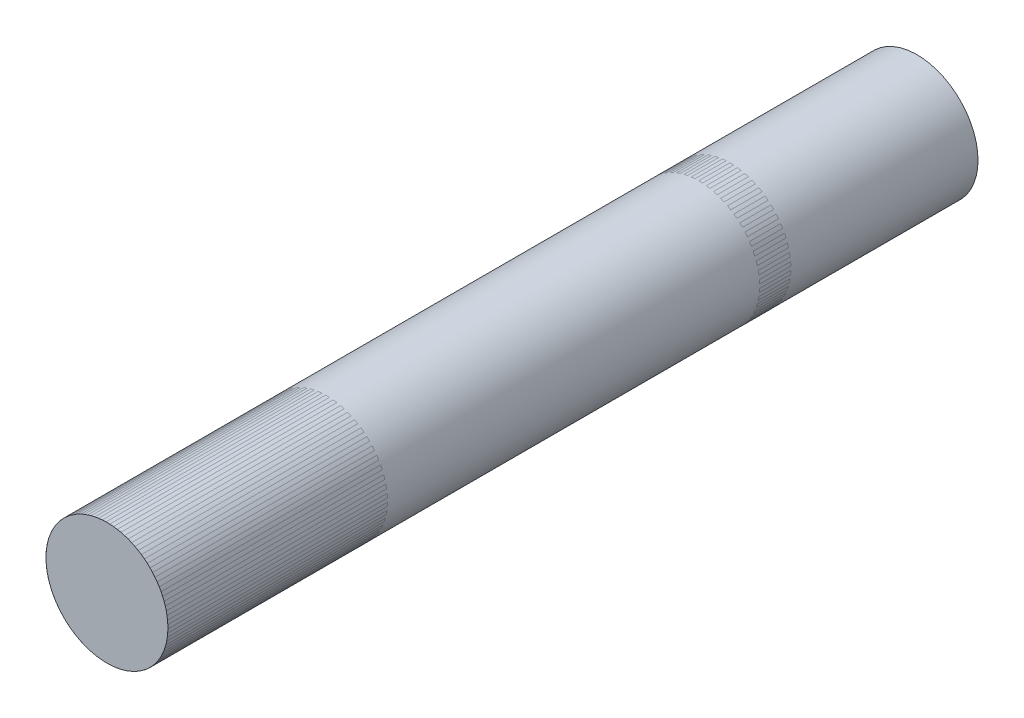
ISO-10303-21;
HEADER;
FILE_DESCRIPTION(('STEP AP214'),'2;1');
FILE_NAME('part.step','',(''),(''),'','','');
FILE_SCHEMA(('AUTOMOTIVE_DESIGN { 1 0 10303 214 1 1 1 1 }'));
ENDSEC;
DATA;
#1=APPLICATION_CONTEXT('core data for automotive mechanical design processes');
#2=APPLICATION_PROTOCOL_DEFINITION('international standard','automotive_design',2000,#1);
#3=PRODUCT_CONTEXT('',#1,'mechanical');
#4=PRODUCT('Part','Part','',(#3));
#5=PRODUCT_RELATED_PRODUCT_CATEGORY('part','',(#4));
#6=PRODUCT_DEFINITION_FORMATION('','',#4);
#7=PRODUCT_DEFINITION_CONTEXT('part definition',#1,'design');
#8=PRODUCT_DEFINITION('design','',#6,#7);
#9=PRODUCT_DEFINITION_SHAPE('','',#8);
#10=(LENGTH_UNIT() NAMED_UNIT(*) SI_UNIT(.MILLI.,.METRE.));
#11=(NAMED_UNIT(*) PLANE_ANGLE_UNIT() SI_UNIT($,.RADIAN.));
#12=(NAMED_UNIT(*) SI_UNIT($,.STERADIAN.) SOLID_ANGLE_UNIT());
#13=UNCERTAINTY_MEASURE_WITH_UNIT(LENGTH_MEASURE(1.E-05),#10,'distance_accuracy_value','');
#14=(GEOMETRIC_REPRESENTATION_CONTEXT(3) GLOBAL_UNCERTAINTY_ASSIGNED_CONTEXT((#13)) GLOBAL_UNIT_ASSIGNED_CONTEXT((#10,
#11,#12)) REPRESENTATION_CONTEXT('',''));
#15=CARTESIAN_POINT('',(0.,0.,0.));
#16=DIRECTION('',(0.,0.,1.));
#17=DIRECTION('',(1.,0.,0.));
#18=AXIS2_PLACEMENT_3D('',#15,#16,#17);
#19=CARTESIAN_POINT('',(0.,0.,70.8278999999999));
#20=DIRECTION('',(0.,0.,-1.));
#21=DIRECTION('',(-1.,0.,0.));
#22=AXIS2_PLACEMENT_3D('',#19,#20,#21);
#23=PLANE('',#22);
#24=CARTESIAN_POINT('',(0.,0.,70.8278999999999));
#25=DIRECTION('',(0.,0.,-1.));
#26=DIRECTION('',(-1.,0.,0.));
#27=AXIS2_PLACEMENT_3D('',#24,#25,#26);
#28=CIRCLE('',#27,6.35);
#29=CARTESIAN_POINT('',(6.34999999999994,0.,70.8278999999999));
#30=VERTEX_POINT('',#29);
#31=EDGE_CURVE('E48',#30,#30,#28,.T.);
#32=ORIENTED_EDGE('',*,*,#31,.F.);
#33=EDGE_LOOP('',(#32));
#34=FACE_BOUND('',#33,.T.);
#35=ADVANCED_FACE('F41',(#34),#23,.F.);
#36=CARTESIAN_POINT('',(0.,0.,-31.4733122421383));
#37=DIRECTION('',(0.,0.,1.));
#38=DIRECTION('',(1.,0.,0.));
#39=AXIS2_PLACEMENT_3D('',#36,#37,#38);
#40=CYLINDRICAL_SURFACE('',#39,6.35);
#41=CARTESIAN_POINT('',(0.,0.,-13.5128));
#42=DIRECTION('',(0.,0.,1.));
#43=DIRECTION('',(1.,0.,0.));
#44=AXIS2_PLACEMENT_3D('',#41,#42,#43);
#45=CIRCLE('',#44,6.35);
#46=CARTESIAN_POINT('',(6.34999999999994,0.,-13.5128));
#47=VERTEX_POINT('',#46);
#48=EDGE_CURVE('E11',#47,#47,#45,.T.);
#49=CARTESIAN_POINT('',(6.34999999999994,0.,-13.5128));
#50=CARTESIAN_POINT('',(6.34999999999994,0.,-12.6342510416667));
#51=CARTESIAN_POINT('',(6.34999999999994,0.,-11.7557020833333));
#52=CARTESIAN_POINT('',(6.34999999999994,0.,-9.99860416666666));
#53=CARTESIAN_POINT('',(6.34999999999994,0.,-9.12005520833333));
#54=CARTESIAN_POINT('',(6.34999999999994,0.,-7.36295729166667));
#55=CARTESIAN_POINT('',(6.34999999999994,0.,-6.48440833333333));
#56=CARTESIAN_POINT('',(6.34999999999994,0.,-4.72731041666667));
#57=CARTESIAN_POINT('',(6.34999999999994,0.,-3.84876145833334));
#58=CARTESIAN_POINT('',(6.34999999999994,0.,-2.09166354166667));
#59=CARTESIAN_POINT('',(6.34999999999994,0.,-1.21311458333334));
#60=CARTESIAN_POINT('',(6.34999999999994,0.,0.543983333333326));
#61=CARTESIAN_POINT('',(6.34999999999994,0.,1.42253229166666));
#62=CARTESIAN_POINT('',(6.34999999999994,0.,3.17963020833332));
#63=CARTESIAN_POINT('',(6.34999999999994,0.,4.05817916666666));
#64=CARTESIAN_POINT('',(6.34999999999994,0.,5.81527708333332));
#65=CARTESIAN_POINT('',(6.34999999999994,0.,6.69382604166665));
#66=CARTESIAN_POINT('',(6.34999999999994,0.,8.45092395833332));
#67=CARTESIAN_POINT('',(6.34999999999994,0.,9.32947291666665));
#68=CARTESIAN_POINT('',(6.34999999999994,0.,11.0865708333333));
#69=CARTESIAN_POINT('',(6.34999999999994,0.,11.9651197916666));
#70=CARTESIAN_POINT('',(6.34999999999994,0.,13.7222177083333));
#71=CARTESIAN_POINT('',(6.34999999999994,0.,14.6007666666666));
#72=CARTESIAN_POINT('',(6.34999999999994,0.,16.3578645833333));
#73=CARTESIAN_POINT('',(6.34999999999994,0.,17.2364135416666));
#74=CARTESIAN_POINT('',(6.34999999999994,0.,18.9935114583333));
#75=CARTESIAN_POINT('',(6.34999999999994,0.,19.8720604166666));
#76=CARTESIAN_POINT('',(6.34999999999994,0.,21.6291583333333));
#77=CARTESIAN_POINT('',(6.34999999999994,0.,22.5077072916666));
#78=CARTESIAN_POINT('',(6.34999999999994,0.,24.2648052083333));
#79=CARTESIAN_POINT('',(6.34999999999994,0.,25.1433541666666));
#80=CARTESIAN_POINT('',(6.34999999999994,0.,26.9004520833333));
#81=CARTESIAN_POINT('',(6.34999999999994,0.,27.7790010416666));
#82=CARTESIAN_POINT('',(6.34999999999994,0.,29.5360989583333));
#83=CARTESIAN_POINT('',(6.34999999999994,0.,30.4146479166666));
#84=CARTESIAN_POINT('',(6.34999999999994,0.,32.1717458333333));
#85=CARTESIAN_POINT('',(6.34999999999994,0.,33.0502947916666));
#86=CARTESIAN_POINT('',(6.34999999999994,0.,34.8073927083333));
#87=CARTESIAN_POINT('',(6.34999999999994,0.,35.6859416666666));
#88=CARTESIAN_POINT('',(6.34999999999994,0.,37.4430395833333));
#89=CARTESIAN_POINT('',(6.34999999999994,0.,38.3215885416666));
#90=CARTESIAN_POINT('',(6.34999999999994,0.,40.0786864583333));
#91=CARTESIAN_POINT('',(6.34999999999994,0.,40.9572354166666));
#92=CARTESIAN_POINT('',(6.34999999999994,0.,42.7143333333333));
#93=CARTESIAN_POINT('',(6.34999999999994,0.,43.5928822916666));
#94=CARTESIAN_POINT('',(6.34999999999994,0.,45.3499802083333));
#95=CARTESIAN_POINT('',(6.34999999999994,0.,46.2285291666666));
#96=CARTESIAN_POINT('',(6.34999999999994,0.,47.9856270833333));
#97=CARTESIAN_POINT('',(6.34999999999994,0.,48.8641760416666));
#98=CARTESIAN_POINT('',(6.34999999999994,0.,50.6212739583333));
#99=CARTESIAN_POINT('',(6.34999999999994,0.,51.4998229166666));
#100=CARTESIAN_POINT('',(6.34999999999994,0.,53.2569208333333));
#101=CARTESIAN_POINT('',(6.34999999999994,0.,54.1354697916666));
#102=CARTESIAN_POINT('',(6.34999999999994,0.,55.8925677083333));
#103=CARTESIAN_POINT('',(6.34999999999994,0.,56.7711166666666));
#104=CARTESIAN_POINT('',(6.34999999999994,0.,58.5282145833333));
#105=CARTESIAN_POINT('',(6.34999999999994,0.,59.4067635416666));
#106=CARTESIAN_POINT('',(6.34999999999994,0.,61.1638614583333));
#107=CARTESIAN_POINT('',(6.34999999999994,0.,62.0424104166666));
#108=CARTESIAN_POINT('',(6.34999999999994,0.,63.7995083333333));
#109=CARTESIAN_POINT('',(6.34999999999994,0.,64.6780572916666));
#110=CARTESIAN_POINT('',(6.34999999999994,0.,66.4351552083333));
#111=CARTESIAN_POINT('',(6.34999999999994,0.,67.3137041666666));
#112=CARTESIAN_POINT('',(6.34999999999994,0.,69.0708020833333));
#113=CARTESIAN_POINT('',(6.34999999999994,0.,69.9493510416666));
#114=CARTESIAN_POINT('',(6.34999999999994,0.,70.8278999999999));
#115=B_SPLINE_CURVE_WITH_KNOTS('',3,(#49,#50,#51,#52,#53,#54,#55,#56,#57,#58,#59,#60,#61,#62,
#63,#64,#65,#66,#67,#68,#69,#70,#71,#72,#73,#74,#75,#76,#77,#78,#79,#80,#81,#82,#83,#84,#85,#86,
#87,#88,#89,#90,#91,#92,#93,#94,#95,#96,#97,#98,#99,#100,#101,#102,#103,#104,#105,#106,#107,
#108,#109,#110,#111,#112,#113,#114),.UNSPECIFIED.,.F.,.F.,(4,2,2,2,2,2,2,2,2,2,2,2,2,2,2,2,2,2,
2,2,2,2,2,2,2,2,2,2,2,2,2,2,4),(0.,2.635646875,5.27129375,7.90694062499999,10.5425875,
13.178234375,15.81388125,18.449528125,21.085175,23.720821875,26.35646875,28.992115625,
31.6277625,34.263409375,36.89905625,39.534703125,42.17035,44.805996875,47.4416437499999,
50.077290625,52.7129375,55.3485843749999,57.98423125,60.6198781249999,63.2555249999999,
65.8911718749999,68.5268187499999,71.162465625,73.7981124999999,76.4337593749999,
79.0694062499999,81.7050531249999,84.3406999999999),.UNSPECIFIED.);
#116=EDGE_CURVE('BSEAM43',#47,#30,#115,.T.);
#117=ORIENTED_EDGE('',*,*,#48,.T.);
#118=ORIENTED_EDGE('',*,*,#31,.T.);
#119=ORIENTED_EDGE('',*,*,#116,.T.);
#120=ORIENTED_EDGE('',*,*,#116,.F.);
#121=EDGE_LOOP('',(#117,#119,#118,#120));
#122=FACE_BOUND('',#121,.T.);
#123=ADVANCED_FACE('F43',(#122),#40,.T.);
#124=CARTESIAN_POINT('',(0.,0.,-13.5128));
#125=DIRECTION('',(0.,0.,1.));
#126=DIRECTION('',(1.,0.,0.));
#127=AXIS2_PLACEMENT_3D('',#124,#125,#126);
#128=PLANE('',#127);
#129=ORIENTED_EDGE('',*,*,#48,.F.);
#130=EDGE_LOOP('',(#129));
#131=FACE_BOUND('',#130,.T.);
#132=ADVANCED_FACE('F59',(#131),#128,.F.);
#133=CLOSED_SHELL('',(#35,#123,#132));
#134=MANIFOLD_SOLID_BREP('B2',#133);
#135=CARTESIAN_POINT('',(0.,0.,9.3472));
#136=DIRECTION('',(0.,0.,1.));
#137=DIRECTION('',(-1.,0.,0.));
#138=AXIS2_PLACEMENT_3D('',#135,#136,#137);
#139=CYLINDRICAL_SURFACE('',#138,6.35);
#140=CARTESIAN_POINT('',(0.,0.,5.969));
#141=DIRECTION('',(0.,0.,-1.));
#142=DIRECTION('',(1.,0.,0.));
#143=AXIS2_PLACEMENT_3D('',#140,#141,#142);
#144=CIRCLE('',#143,6.35);
#145=CARTESIAN_POINT('',(-6.35000000000006,0.,5.969));
#146=VERTEX_POINT('',#145);
#147=EDGE_CURVE('E92',#146,#146,#144,.T.);
#148=CARTESIAN_POINT('',(0.,0.,9.22019999999999));
#149=DIRECTION('',(0.,0.,1.));
#150=DIRECTION('',(-1.,0.,0.));
#151=AXIS2_PLACEMENT_3D('',#148,#149,#150);
#152=CIRCLE('',#151,6.35);
#153=CARTESIAN_POINT('',(-6.35000000000006,0.,9.22019999999999));
#154=VERTEX_POINT('',#153);
#155=EDGE_CURVE('E40',#154,#154,#152,.T.);
#156=CARTESIAN_POINT('',(-6.35000000000006,0.,5.969));
#157=CARTESIAN_POINT('',(-6.35000000000006,0.,6.00286666666667));
#158=CARTESIAN_POINT('',(-6.35000000000006,0.,6.03673333333334));
#159=CARTESIAN_POINT('',(-6.35000000000006,0.,6.10446666666667));
#160=CARTESIAN_POINT('',(-6.35000000000006,0.,6.13833333333334));
#161=CARTESIAN_POINT('',(-6.35000000000006,0.,6.20606666666667));
#162=CARTESIAN_POINT('',(-6.35000000000006,0.,6.23993333333333));
#163=CARTESIAN_POINT('',(-6.35000000000006,0.,6.30766666666667));
#164=CARTESIAN_POINT('',(-6.35000000000006,0.,6.34153333333333));
#165=CARTESIAN_POINT('',(-6.35000000000006,0.,6.40926666666667));
#166=CARTESIAN_POINT('',(-6.35000000000006,0.,6.44313333333333));
#167=CARTESIAN_POINT('',(-6.35000000000006,0.,6.51086666666667));
#168=CARTESIAN_POINT('',(-6.35000000000006,0.,6.54473333333333));
#169=CARTESIAN_POINT('',(-6.35000000000006,0.,6.61246666666667));
#170=CARTESIAN_POINT('',(-6.35000000000006,0.,6.64633333333333));
#171=CARTESIAN_POINT('',(-6.35000000000006,0.,6.71406666666667));
#172=CARTESIAN_POINT('',(-6.35000000000006,0.,6.74793333333333));
#173=CARTESIAN_POINT('',(-6.35000000000006,0.,6.81566666666667));
#174=CARTESIAN_POINT('',(-6.35000000000006,0.,6.84953333333333));
#175=CARTESIAN_POINT('',(-6.35000000000006,0.,6.91726666666667));
#176=CARTESIAN_POINT('',(-6.35000000000006,0.,6.95113333333333));
#177=CARTESIAN_POINT('',(-6.35000000000006,0.,7.01886666666667));
#178=CARTESIAN_POINT('',(-6.35000000000006,0.,7.05273333333333));
#179=CARTESIAN_POINT('',(-6.35000000000006,0.,7.12046666666667));
#180=CARTESIAN_POINT('',(-6.35000000000006,0.,7.15433333333333));
#181=CARTESIAN_POINT('',(-6.35000000000006,0.,7.22206666666667));
#182=CARTESIAN_POINT('',(-6.35000000000006,0.,7.25593333333333));
#183=CARTESIAN_POINT('',(-6.35000000000006,0.,7.32366666666667));
#184=CARTESIAN_POINT('',(-6.35000000000006,0.,7.35753333333333));
#185=CARTESIAN_POINT('',(-6.35000000000006,0.,7.42526666666667));
#186=CARTESIAN_POINT('',(-6.35000000000006,0.,7.45913333333333));
#187=CARTESIAN_POINT('',(-6.35000000000006,0.,7.52686666666667));
#188=CARTESIAN_POINT('',(-6.35000000000006,0.,7.56073333333333));
#189=CARTESIAN_POINT('',(-6.35000000000006,0.,7.62846666666667));
#190=CARTESIAN_POINT('',(-6.35000000000006,0.,7.66233333333333));
#191=CARTESIAN_POINT('',(-6.35000000000006,0.,7.73006666666666));
#192=CARTESIAN_POINT('',(-6.35000000000006,0.,7.76393333333333));
#193=CARTESIAN_POINT('',(-6.35000000000006,0.,7.83166666666666));
#194=CARTESIAN_POINT('',(-6.35000000000006,0.,7.86553333333333));
#195=CARTESIAN_POINT('',(-6.35000000000006,0.,7.93326666666666));
#196=CARTESIAN_POINT('',(-6.35000000000006,0.,7.96713333333333));
#197=CARTESIAN_POINT('',(-6.35000000000006,0.,8.03486666666666));
#198=CARTESIAN_POINT('',(-6.35000000000006,0.,8.06873333333333));
#199=CARTESIAN_POINT('',(-6.35000000000006,0.,8.13646666666666));
#200=CARTESIAN_POINT('',(-6.35000000000006,0.,8.17033333333333));
#201=CARTESIAN_POINT('',(-6.35000000000006,0.,8.23806666666666));
#202=CARTESIAN_POINT('',(-6.35000000000006,0.,8.27193333333333));
#203=CARTESIAN_POINT('',(-6.35000000000006,0.,8.33966666666666));
#204=CARTESIAN_POINT('',(-6.35000000000006,0.,8.37353333333333));
#205=CARTESIAN_POINT('',(-6.35000000000006,0.,8.44126666666666));
#206=CARTESIAN_POINT('',(-6.35000000000006,0.,8.47513333333333));
#207=CARTESIAN_POINT('',(-6.35000000000006,0.,8.54286666666666));
#208=CARTESIAN_POINT('',(-6.35000000000006,0.,8.57673333333333));
#209=CARTESIAN_POINT('',(-6.35000000000006,0.,8.64446666666666));
#210=CARTESIAN_POINT('',(-6.35000000000006,0.,8.67833333333333));
#211=CARTESIAN_POINT('',(-6.35000000000006,0.,8.74606666666666));
#212=CARTESIAN_POINT('',(-6.35000000000006,0.,8.77993333333333));
#213=CARTESIAN_POINT('',(-6.35000000000006,0.,8.84766666666666));
#214=CARTESIAN_POINT('',(-6.35000000000006,0.,8.88153333333333));
#215=CARTESIAN_POINT('',(-6.35000000000006,0.,8.94926666666666));
#216=CARTESIAN_POINT('',(-6.35000000000006,0.,8.98313333333333));
#217=CARTESIAN_POINT('',(-6.35000000000006,0.,9.05086666666666));
#218=CARTESIAN_POINT('',(-6.35000000000006,0.,9.08473333333333));
#219=CARTESIAN_POINT('',(-6.35000000000006,0.,9.15246666666666));
#220=CARTESIAN_POINT('',(-6.35000000000006,0.,9.18633333333333));
#221=CARTESIAN_POINT('',(-6.35000000000006,0.,9.22019999999999));
#222=B_SPLINE_CURVE_WITH_KNOTS('',3,(#156,#157,#158,#159,#160,#161,#162,#163,#164,#165,#166,
#167,#168,#169,#170,#171,#172,#173,#174,#175,#176,#177,#178,#179,#180,#181,#182,#183,#184,#185,
#186,#187,#188,#189,#190,#191,#192,#193,#194,#195,#196,#197,#198,#199,#200,#201,#202,#203,#204,
#205,#206,#207,#208,#209,#210,#211,#212,#213,#214,#215,#216,#217,#218,#219,#220,#221),
.UNSPECIFIED.,.F.,.F.,(4,2,2,2,2,2,2,2,2,2,2,2,2,2,2,2,2,2,2,2,2,2,2,2,2,2,2,2,2,2,2,2,4),(0.,
0.1016,0.2032,0.304799999999999,0.406399999999999,0.508,0.609599999999998,0.711199999999999,
0.812799999999999,0.914399999999998,1.016,1.1176,1.2192,1.3208,1.4224,1.524,1.6256,1.7272,
1.8288,1.9304,2.032,2.13359999999999,2.23519999999999,2.33679999999999,2.43839999999999,
2.53999999999999,2.64159999999999,2.74319999999999,2.84479999999999,2.94639999999999,
3.04799999999999,3.14959999999999,3.25119999999999),.UNSPECIFIED.);
#223=EDGE_CURVE('BSEAM88',#146,#154,#222,.T.);
#224=ORIENTED_EDGE('',*,*,#147,.T.);
#225=ORIENTED_EDGE('',*,*,#155,.T.);
#226=ORIENTED_EDGE('',*,*,#223,.T.);
#227=ORIENTED_EDGE('',*,*,#223,.F.);
#228=EDGE_LOOP('',(#224,#226,#225,#227));
#229=FACE_BOUND('',#228,.T.);
#230=ADVANCED_FACE('F88',(#229),#139,.F.);
#231=OPEN_SHELL('',(#230));
#232=SHELL_BASED_SURFACE_MODEL('B6',(#231));
#233=CARTESIAN_POINT('',(0.,-1.2490009027033E-13,59.3978999999999));
#234=DIRECTION('',(0.,0.,1.));
#235=DIRECTION('',(0.,1.,0.));
#236=AXIS2_PLACEMENT_3D('',#233,#234,#235);
#237=CYLINDRICAL_SURFACE('',#236,6.35);
#238=CARTESIAN_POINT('',(0.,-1.17961196366423E-13,47.9678999999999));
#239=DIRECTION('',(0.,0.,1.));
#240=DIRECTION('',(0.,1.,0.));
#241=AXIS2_PLACEMENT_3D('',#238,#239,#240);
#242=CIRCLE('',#241,6.35);
#243=CARTESIAN_POINT('',(0.,6.34999999999988,47.9678999999999));
#244=VERTEX_POINT('',#243);
#245=EDGE_CURVE('E116',#244,#244,#242,.T.);
#246=ORIENTED_EDGE('',*,*,#245,.F.);
#247=EDGE_LOOP('',(#246));
#248=FACE_BOUND('',#247,.T.);
#249=CARTESIAN_POINT('',(0.,-1.2490009027033E-13,70.8278999999999));
#250=DIRECTION('',(0.,0.,1.));
#251=DIRECTION('',(0.,1.,0.));
#252=AXIS2_PLACEMENT_3D('',#249,#250,#251);
#253=CIRCLE('',#252,6.35);
#254=CARTESIAN_POINT('',(0.,6.34999999999987,70.8278999999999));
#255=VERTEX_POINT('',#254);
#256=EDGE_CURVE('E87',#255,#255,#253,.F.);
#257=ORIENTED_EDGE('',*,*,#256,.F.);
#258=EDGE_LOOP('',(#257));
#259=FACE_BOUND('',#258,.T.);
#260=ADVANCED_FACE('F112',(#248,#259),#237,.F.);
#261=OPEN_SHELL('',(#260));
#262=SHELL_BASED_SURFACE_MODEL('B35',(#261));
#263=ADVANCED_BREP_SHAPE_REPRESENTATION('',(#18,#134),#14);
#264=MANIFOLD_SURFACE_SHAPE_REPRESENTATION('',(#18,#232,#262),#14);
#265=SHAPE_REPRESENTATION('',(#18),#14);
#266=SHAPE_DEFINITION_REPRESENTATION(#9,#265);
#267=SHAPE_REPRESENTATION_RELATIONSHIP('','',#265,#263);
#268=SHAPE_REPRESENTATION_RELATIONSHIP('','',#265,#264);
ENDSEC;
END-ISO-10303-21;
